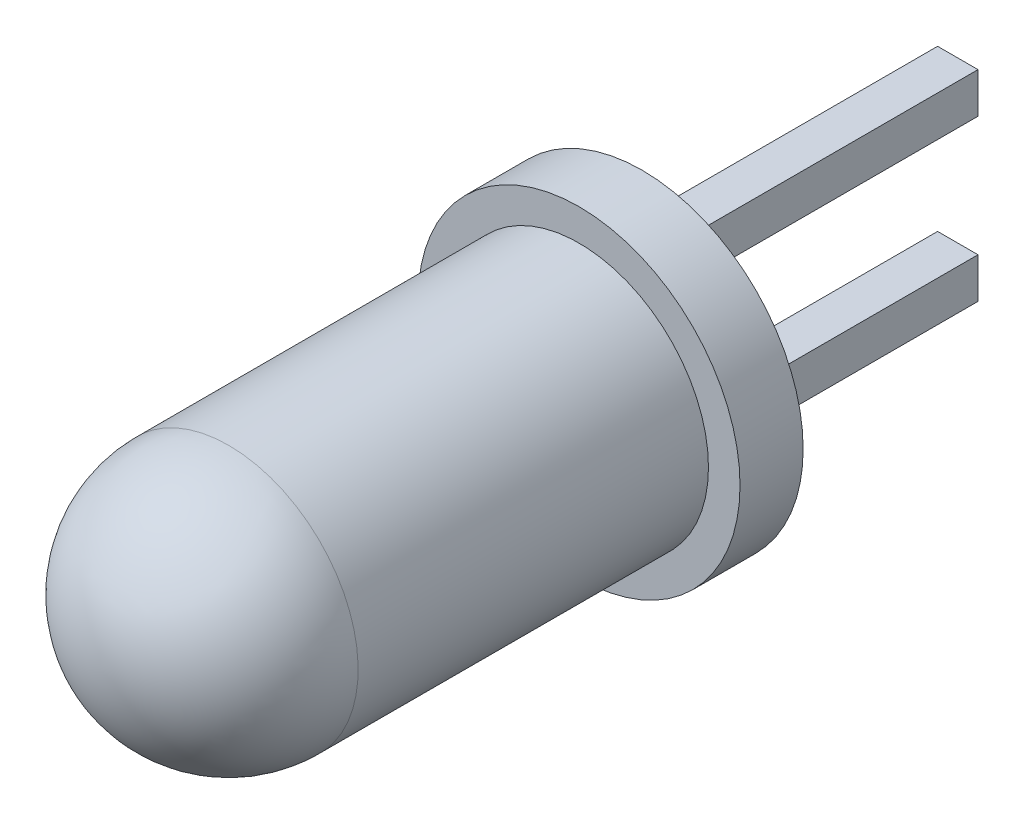
ISO-10303-21;
HEADER;
FILE_DESCRIPTION(('STEP AP214'),'2;1');
FILE_NAME('part.step','',(''),(''),'','','');
FILE_SCHEMA(('AUTOMOTIVE_DESIGN { 1 0 10303 214 1 1 1 1 }'));
ENDSEC;
DATA;
#1=APPLICATION_CONTEXT('core data for automotive mechanical design processes');
#2=APPLICATION_PROTOCOL_DEFINITION('international standard','automotive_design',2000,#1);
#3=PRODUCT_CONTEXT('',#1,'mechanical');
#4=PRODUCT('Part','Part','',(#3));
#5=PRODUCT_RELATED_PRODUCT_CATEGORY('part','',(#4));
#6=PRODUCT_DEFINITION_FORMATION('','',#4);
#7=PRODUCT_DEFINITION_CONTEXT('part definition',#1,'design');
#8=PRODUCT_DEFINITION('design','',#6,#7);
#9=PRODUCT_DEFINITION_SHAPE('','',#8);
#10=(LENGTH_UNIT() NAMED_UNIT(*) SI_UNIT(.MILLI.,.METRE.));
#11=(NAMED_UNIT(*) PLANE_ANGLE_UNIT() SI_UNIT($,.RADIAN.));
#12=(NAMED_UNIT(*) SI_UNIT($,.STERADIAN.) SOLID_ANGLE_UNIT());
#13=UNCERTAINTY_MEASURE_WITH_UNIT(LENGTH_MEASURE(1.E-05),#10,'distance_accuracy_value','');
#14=(GEOMETRIC_REPRESENTATION_CONTEXT(3) GLOBAL_UNCERTAINTY_ASSIGNED_CONTEXT((#13)) GLOBAL_UNIT_ASSIGNED_CONTEXT((#10,
#11,#12)) REPRESENTATION_CONTEXT('',''));
#15=CARTESIAN_POINT('',(0.,0.,0.));
#16=DIRECTION('',(0.,0.,1.));
#17=DIRECTION('',(1.,0.,0.));
#18=AXIS2_PLACEMENT_3D('',#15,#16,#17);
#19=CARTESIAN_POINT('',(0.,0.,0.));
#20=DIRECTION('',(0.,0.,-1.));
#21=DIRECTION('',(-1.,0.,0.));
#22=AXIS2_PLACEMENT_3D('',#19,#20,#21);
#23=PLANE('',#22);
#24=DIRECTION('',(1.,0.,0.));
#25=VECTOR('',#24,1.);
#26=CARTESIAN_POINT('',(-0.32,0.95,0.));
#27=LINE('',#26,#25);
#28=CARTESIAN_POINT('',(-0.32,0.95,0.));
#29=VERTEX_POINT('',#28);
#30=CARTESIAN_POINT('',(0.32,0.95,0.));
#31=VERTEX_POINT('',#30);
#32=EDGE_CURVE('E147',#29,#31,#27,.T.);
#33=ORIENTED_EDGE('',*,*,#32,.T.);
#34=DIRECTION('',(0.,-1.,0.));
#35=VECTOR('',#34,1.);
#36=CARTESIAN_POINT('',(0.32,1.59,0.));
#37=LINE('',#36,#35);
#38=CARTESIAN_POINT('',(0.32,1.59,0.));
#39=VERTEX_POINT('',#38);
#40=EDGE_CURVE('E113',#39,#31,#37,.T.);
#41=ORIENTED_EDGE('',*,*,#40,.F.);
#42=DIRECTION('',(-1.,0.,0.));
#43=VECTOR('',#42,1.);
#44=CARTESIAN_POINT('',(0.32,1.59,0.));
#45=LINE('',#44,#43);
#46=CARTESIAN_POINT('',(-0.32,1.59,0.));
#47=VERTEX_POINT('',#46);
#48=EDGE_CURVE('E136',#39,#47,#45,.T.);
#49=ORIENTED_EDGE('',*,*,#48,.T.);
#50=DIRECTION('',(0.,1.,0.));
#51=VECTOR('',#50,1.);
#52=CARTESIAN_POINT('',(-0.32,0.95,0.));
#53=LINE('',#52,#51);
#54=EDGE_CURVE('E149',#29,#47,#53,.T.);
#55=ORIENTED_EDGE('',*,*,#54,.F.);
#56=EDGE_LOOP('',(#33,#41,#49,#55));
#57=FACE_BOUND('',#56,.T.);
#58=CARTESIAN_POINT('',(0.,0.,0.));
#59=DIRECTION('',(0.,0.,-1.));
#60=DIRECTION('',(-1.,0.,0.));
#61=AXIS2_PLACEMENT_3D('',#58,#59,#60);
#62=CIRCLE('',#61,2.55);
#63=CARTESIAN_POINT('',(-2.55,0.,0.));
#64=VERTEX_POINT('',#63);
#65=EDGE_CURVE('E11',#64,#64,#62,.T.);
#66=ORIENTED_EDGE('',*,*,#65,.T.);
#67=EDGE_LOOP('',(#66));
#68=FACE_BOUND('',#67,.T.);
#69=DIRECTION('',(1.,0.,0.));
#70=VECTOR('',#69,1.);
#71=CARTESIAN_POINT('',(-0.32,-1.59,0.));
#72=LINE('',#71,#70);
#73=CARTESIAN_POINT('',(-0.32,-1.59,0.));
#74=VERTEX_POINT('',#73);
#75=CARTESIAN_POINT('',(0.320000000000001,-1.59,0.));
#76=VERTEX_POINT('',#75);
#77=EDGE_CURVE('E47',#74,#76,#72,.T.);
#78=ORIENTED_EDGE('',*,*,#77,.T.);
#79=DIRECTION('',(0.,-1.,0.));
#80=VECTOR('',#79,1.);
#81=CARTESIAN_POINT('',(0.320000000000001,-0.95,0.));
#82=LINE('',#81,#80);
#83=CARTESIAN_POINT('',(0.320000000000001,-0.95,0.));
#84=VERTEX_POINT('',#83);
#85=EDGE_CURVE('E111',#84,#76,#82,.T.);
#86=ORIENTED_EDGE('',*,*,#85,.F.);
#87=DIRECTION('',(-1.,0.,0.));
#88=VECTOR('',#87,1.);
#89=CARTESIAN_POINT('',(0.320000000000001,-0.95,0.));
#90=LINE('',#89,#88);
#91=CARTESIAN_POINT('',(-0.32,-0.95,0.));
#92=VERTEX_POINT('',#91);
#93=EDGE_CURVE('E106',#84,#92,#90,.T.);
#94=ORIENTED_EDGE('',*,*,#93,.T.);
#95=DIRECTION('',(0.,1.,0.));
#96=VECTOR('',#95,1.);
#97=CARTESIAN_POINT('',(-0.32,-1.59,0.));
#98=LINE('',#97,#96);
#99=EDGE_CURVE('E52',#74,#92,#98,.T.);
#100=ORIENTED_EDGE('',*,*,#99,.F.);
#101=EDGE_LOOP('',(#78,#86,#94,#100));
#102=FACE_BOUND('',#101,.T.);
#103=ADVANCED_FACE('F33',(#57,#68,#102),#23,.T.);
#104=CARTESIAN_POINT('',(0.,0.,0.));
#105=DIRECTION('',(0.,0.,-1.));
#106=DIRECTION('',(-1.,0.,0.));
#107=AXIS2_PLACEMENT_3D('',#104,#105,#106);
#108=CYLINDRICAL_SURFACE('',#107,2.55);
#109=CARTESIAN_POINT('',(0.,0.,1.));
#110=DIRECTION('',(0.,0.,-1.));
#111=DIRECTION('',(-1.,0.,0.));
#112=AXIS2_PLACEMENT_3D('',#109,#110,#111);
#113=CIRCLE('',#112,2.55);
#114=CARTESIAN_POINT('',(-2.55,0.,1.));
#115=VERTEX_POINT('',#114);
#116=EDGE_CURVE('E40',#115,#115,#113,.T.);
#117=ORIENTED_EDGE('',*,*,#116,.T.);
#118=EDGE_LOOP('',(#117));
#119=FACE_BOUND('',#118,.T.);
#120=ORIENTED_EDGE('',*,*,#65,.F.);
#121=EDGE_LOOP('',(#120));
#122=FACE_BOUND('',#121,.T.);
#123=ADVANCED_FACE('F172',(#119,#122),#108,.T.);
#124=CARTESIAN_POINT('',(0.,2.55,1.));
#125=DIRECTION('',(0.,0.,1.));
#126=DIRECTION('',(1.,0.,0.));
#127=AXIS2_PLACEMENT_3D('',#124,#125,#126);
#128=PLANE('',#127);
#129=CARTESIAN_POINT('',(0.,0.,1.));
#130=DIRECTION('',(0.,0.,-1.));
#131=DIRECTION('',(-1.,0.,0.));
#132=AXIS2_PLACEMENT_3D('',#129,#130,#131);
#133=CIRCLE('',#132,2.05);
#134=CARTESIAN_POINT('',(-2.05,0.,1.));
#135=VERTEX_POINT('',#134);
#136=EDGE_CURVE('E167',#135,#135,#133,.T.);
#137=ORIENTED_EDGE('',*,*,#136,.T.);
#138=EDGE_LOOP('',(#137));
#139=FACE_BOUND('',#138,.T.);
#140=ORIENTED_EDGE('',*,*,#116,.F.);
#141=EDGE_LOOP('',(#140));
#142=FACE_BOUND('',#141,.T.);
#143=ADVANCED_FACE('F175',(#139,#142),#128,.T.);
#144=CARTESIAN_POINT('',(0.,0.,0.));
#145=DIRECTION('',(0.,0.,-1.));
#146=DIRECTION('',(-1.,0.,0.));
#147=AXIS2_PLACEMENT_3D('',#144,#145,#146);
#148=CYLINDRICAL_SURFACE('',#147,2.05);
#149=CARTESIAN_POINT('',(0.,0.,6.55));
#150=DIRECTION('',(0.,0.,-1.));
#151=DIRECTION('',(-1.,0.,0.));
#152=AXIS2_PLACEMENT_3D('',#149,#150,#151);
#153=CIRCLE('',#152,2.05);
#154=CARTESIAN_POINT('',(-2.05,0.,6.55));
#155=VERTEX_POINT('',#154);
#156=EDGE_CURVE('E164',#155,#155,#153,.T.);
#157=ORIENTED_EDGE('',*,*,#156,.T.);
#158=EDGE_LOOP('',(#157));
#159=FACE_BOUND('',#158,.T.);
#160=ORIENTED_EDGE('',*,*,#136,.F.);
#161=EDGE_LOOP('',(#160));
#162=FACE_BOUND('',#161,.T.);
#163=ADVANCED_FACE('F177',(#159,#162),#148,.T.);
#164=CARTESIAN_POINT('',(0.,0.,6.55));
#165=DIRECTION('',(0.,0.,-1.));
#166=DIRECTION('',(0.,1.,0.));
#167=AXIS2_PLACEMENT_3D('',#164,#165,#166);
#168=SPHERICAL_SURFACE('',#167,2.05);
#169=ORIENTED_EDGE('',*,*,#156,.F.);
#170=EDGE_LOOP('',(#169));
#171=FACE_BOUND('',#170,.T.);
#172=ADVANCED_FACE('F184',(#171),#168,.T.);
#173=CARTESIAN_POINT('',(0.32,1.59,-5.));
#174=DIRECTION('',(-1.,0.,0.));
#175=DIRECTION('',(0.,-1.,0.));
#176=AXIS2_PLACEMENT_3D('',#173,#174,#175);
#177=PLANE('',#176);
#178=ORIENTED_EDGE('',*,*,#40,.T.);
#179=DIRECTION('',(0.,0.,1.));
#180=VECTOR('',#179,1.);
#181=CARTESIAN_POINT('',(0.32,0.95,-5.));
#182=LINE('',#181,#180);
#183=CARTESIAN_POINT('',(0.32,0.95,-5.));
#184=VERTEX_POINT('',#183);
#185=EDGE_CURVE('E161',#184,#31,#182,.T.);
#186=ORIENTED_EDGE('',*,*,#185,.F.);
#187=DIRECTION('',(0.,-1.,0.));
#188=VECTOR('',#187,1.);
#189=CARTESIAN_POINT('',(0.32,1.59,-5.));
#190=LINE('',#189,#188);
#191=CARTESIAN_POINT('',(0.32,1.59,-5.));
#192=VERTEX_POINT('',#191);
#193=EDGE_CURVE('E133',#192,#184,#190,.T.);
#194=ORIENTED_EDGE('',*,*,#193,.F.);
#195=DIRECTION('',(0.,0.,1.));
#196=VECTOR('',#195,1.);
#197=CARTESIAN_POINT('',(0.32,1.59,-5.));
#198=LINE('',#197,#196);
#199=EDGE_CURVE('E144',#192,#39,#198,.T.);
#200=ORIENTED_EDGE('',*,*,#199,.T.);
#201=EDGE_LOOP('',(#178,#186,#194,#200));
#202=FACE_BOUND('',#201,.T.);
#203=ADVANCED_FACE('F200',(#202),#177,.F.);
#204=CARTESIAN_POINT('',(-0.32,0.95,-5.));
#205=DIRECTION('',(0.,-1.,0.));
#206=DIRECTION('',(1.,0.,0.));
#207=AXIS2_PLACEMENT_3D('',#204,#205,#206);
#208=PLANE('',#207);
#209=ORIENTED_EDGE('',*,*,#32,.F.);
#210=DIRECTION('',(0.,0.,1.));
#211=VECTOR('',#210,1.);
#212=CARTESIAN_POINT('',(-0.32,0.95,-5.));
#213=LINE('',#212,#211);
#214=CARTESIAN_POINT('',(-0.32,0.95,-5.));
#215=VERTEX_POINT('',#214);
#216=EDGE_CURVE('E158',#215,#29,#213,.T.);
#217=ORIENTED_EDGE('',*,*,#216,.F.);
#218=DIRECTION('',(1.,0.,0.));
#219=VECTOR('',#218,1.);
#220=CARTESIAN_POINT('',(-0.32,0.95,-5.));
#221=LINE('',#220,#219);
#222=EDGE_CURVE('E135',#215,#184,#221,.T.);
#223=ORIENTED_EDGE('',*,*,#222,.T.);
#224=ORIENTED_EDGE('',*,*,#185,.T.);
#225=EDGE_LOOP('',(#209,#217,#223,#224));
#226=FACE_BOUND('',#225,.T.);
#227=ADVANCED_FACE('F196',(#226),#208,.T.);
#228=CARTESIAN_POINT('',(-0.32,0.95,-5.));
#229=DIRECTION('',(1.,0.,0.));
#230=DIRECTION('',(0.,1.,0.));
#231=AXIS2_PLACEMENT_3D('',#228,#229,#230);
#232=PLANE('',#231);
#233=ORIENTED_EDGE('',*,*,#54,.T.);
#234=DIRECTION('',(0.,0.,1.));
#235=VECTOR('',#234,1.);
#236=CARTESIAN_POINT('',(-0.32,1.59,-5.));
#237=LINE('',#236,#235);
#238=CARTESIAN_POINT('',(-0.32,1.59,-5.));
#239=VERTEX_POINT('',#238);
#240=EDGE_CURVE('E155',#239,#47,#237,.T.);
#241=ORIENTED_EDGE('',*,*,#240,.F.);
#242=DIRECTION('',(0.,1.,0.));
#243=VECTOR('',#242,1.);
#244=CARTESIAN_POINT('',(-0.32,0.95,-5.));
#245=LINE('',#244,#243);
#246=EDGE_CURVE('E139',#215,#239,#245,.T.);
#247=ORIENTED_EDGE('',*,*,#246,.F.);
#248=ORIENTED_EDGE('',*,*,#216,.T.);
#249=EDGE_LOOP('',(#233,#241,#247,#248));
#250=FACE_BOUND('',#249,.T.);
#251=ADVANCED_FACE('F208',(#250),#232,.F.);
#252=CARTESIAN_POINT('',(0.32,1.59,-5.));
#253=DIRECTION('',(0.,1.,0.));
#254=DIRECTION('',(0.,0.,1.));
#255=AXIS2_PLACEMENT_3D('',#252,#253,#254);
#256=PLANE('',#255);
#257=ORIENTED_EDGE('',*,*,#48,.F.);
#258=ORIENTED_EDGE('',*,*,#199,.F.);
#259=DIRECTION('',(-1.,0.,0.));
#260=VECTOR('',#259,1.);
#261=CARTESIAN_POINT('',(0.32,1.59,-5.));
#262=LINE('',#261,#260);
#263=EDGE_CURVE('E141',#192,#239,#262,.T.);
#264=ORIENTED_EDGE('',*,*,#263,.T.);
#265=ORIENTED_EDGE('',*,*,#240,.T.);
#266=EDGE_LOOP('',(#257,#258,#264,#265));
#267=FACE_BOUND('',#266,.T.);
#268=ADVANCED_FACE('F204',(#267),#256,.T.);
#269=CARTESIAN_POINT('',(0.32,0.95,-5.));
#270=DIRECTION('',(0.,0.,1.));
#271=DIRECTION('',(1.,0.,0.));
#272=AXIS2_PLACEMENT_3D('',#269,#270,#271);
#273=PLANE('',#272);
#274=ORIENTED_EDGE('',*,*,#193,.T.);
#275=ORIENTED_EDGE('',*,*,#222,.F.);
#276=ORIENTED_EDGE('',*,*,#246,.T.);
#277=ORIENTED_EDGE('',*,*,#263,.F.);
#278=EDGE_LOOP('',(#274,#275,#276,#277));
#279=FACE_BOUND('',#278,.T.);
#280=ADVANCED_FACE('F210',(#279),#273,.F.);
#281=CARTESIAN_POINT('',(0.320000000000001,-0.95,-5.));
#282=DIRECTION('',(-1.,0.,0.));
#283=DIRECTION('',(0.,-1.,0.));
#284=AXIS2_PLACEMENT_3D('',#281,#282,#283);
#285=PLANE('',#284);
#286=ORIENTED_EDGE('',*,*,#85,.T.);
#287=DIRECTION('',(0.,0.,1.));
#288=VECTOR('',#287,1.);
#289=CARTESIAN_POINT('',(0.320000000000001,-1.59,-5.));
#290=LINE('',#289,#288);
#291=CARTESIAN_POINT('',(0.320000000000001,-1.59,-5.));
#292=VERTEX_POINT('',#291);
#293=EDGE_CURVE('E109',#292,#76,#290,.T.);
#294=ORIENTED_EDGE('',*,*,#293,.F.);
#295=DIRECTION('',(0.,-1.,0.));
#296=VECTOR('',#295,1.);
#297=CARTESIAN_POINT('',(0.320000000000001,-0.95,-5.));
#298=LINE('',#297,#296);
#299=CARTESIAN_POINT('',(0.320000000000001,-0.95,-5.));
#300=VERTEX_POINT('',#299);
#301=EDGE_CURVE('E97',#300,#292,#298,.T.);
#302=ORIENTED_EDGE('',*,*,#301,.F.);
#303=DIRECTION('',(0.,0.,1.));
#304=VECTOR('',#303,1.);
#305=CARTESIAN_POINT('',(0.320000000000001,-0.95,-5.));
#306=LINE('',#305,#304);
#307=EDGE_CURVE('E123',#300,#84,#306,.T.);
#308=ORIENTED_EDGE('',*,*,#307,.T.);
#309=EDGE_LOOP('',(#286,#294,#302,#308));
#310=FACE_BOUND('',#309,.T.);
#311=ADVANCED_FACE('F110',(#310),#285,.F.);
#312=CARTESIAN_POINT('',(-0.32,-1.59,-5.));
#313=DIRECTION('',(0.,-1.,0.));
#314=DIRECTION('',(1.,0.,0.));
#315=AXIS2_PLACEMENT_3D('',#312,#313,#314);
#316=PLANE('',#315);
#317=ORIENTED_EDGE('',*,*,#77,.F.);
#318=DIRECTION('',(0.,0.,1.));
#319=VECTOR('',#318,1.);
#320=CARTESIAN_POINT('',(-0.32,-1.59,-5.));
#321=LINE('',#320,#319);
#322=CARTESIAN_POINT('',(-0.32,-1.59,-5.));
#323=VERTEX_POINT('',#322);
#324=EDGE_CURVE('E114',#323,#74,#321,.T.);
#325=ORIENTED_EDGE('',*,*,#324,.F.);
#326=DIRECTION('',(1.,0.,0.));
#327=VECTOR('',#326,1.);
#328=CARTESIAN_POINT('',(-0.32,-1.59,-5.));
#329=LINE('',#328,#327);
#330=EDGE_CURVE('E101',#323,#292,#329,.T.);
#331=ORIENTED_EDGE('',*,*,#330,.T.);
#332=ORIENTED_EDGE('',*,*,#293,.T.);
#333=EDGE_LOOP('',(#317,#325,#331,#332));
#334=FACE_BOUND('',#333,.T.);
#335=ADVANCED_FACE('F116',(#334),#316,.T.);
#336=CARTESIAN_POINT('',(-0.32,-1.59,-5.));
#337=DIRECTION('',(1.,0.,0.));
#338=DIRECTION('',(0.,0.,-1.));
#339=AXIS2_PLACEMENT_3D('',#336,#337,#338);
#340=PLANE('',#339);
#341=ORIENTED_EDGE('',*,*,#99,.T.);
#342=DIRECTION('',(0.,0.,1.));
#343=VECTOR('',#342,1.);
#344=CARTESIAN_POINT('',(-0.32,-0.95,-5.));
#345=LINE('',#344,#343);
#346=CARTESIAN_POINT('',(-0.32,-0.95,-5.));
#347=VERTEX_POINT('',#346);
#348=EDGE_CURVE('E129',#347,#92,#345,.T.);
#349=ORIENTED_EDGE('',*,*,#348,.F.);
#350=DIRECTION('',(0.,1.,0.));
#351=VECTOR('',#350,1.);
#352=CARTESIAN_POINT('',(-0.32,-1.59,-5.));
#353=LINE('',#352,#351);
#354=EDGE_CURVE('E118',#323,#347,#353,.T.);
#355=ORIENTED_EDGE('',*,*,#354,.F.);
#356=ORIENTED_EDGE('',*,*,#324,.T.);
#357=EDGE_LOOP('',(#341,#349,#355,#356));
#358=FACE_BOUND('',#357,.T.);
#359=ADVANCED_FACE('F272',(#358),#340,.F.);
#360=CARTESIAN_POINT('',(0.320000000000001,-0.95,-5.));
#361=DIRECTION('',(0.,1.,0.));
#362=DIRECTION('',(-1.,0.,0.));
#363=AXIS2_PLACEMENT_3D('',#360,#361,#362);
#364=PLANE('',#363);
#365=ORIENTED_EDGE('',*,*,#93,.F.);
#366=ORIENTED_EDGE('',*,*,#307,.F.);
#367=DIRECTION('',(-1.,0.,0.));
#368=VECTOR('',#367,1.);
#369=CARTESIAN_POINT('',(0.320000000000001,-0.95,-5.));
#370=LINE('',#369,#368);
#371=EDGE_CURVE('E103',#300,#347,#370,.T.);
#372=ORIENTED_EDGE('',*,*,#371,.T.);
#373=ORIENTED_EDGE('',*,*,#348,.T.);
#374=EDGE_LOOP('',(#365,#366,#372,#373));
#375=FACE_BOUND('',#374,.T.);
#376=ADVANCED_FACE('F280',(#375),#364,.T.);
#377=CARTESIAN_POINT('',(0.320000000000001,-0.95,-5.));
#378=DIRECTION('',(0.,0.,-1.));
#379=DIRECTION('',(-1.,0.,0.));
#380=AXIS2_PLACEMENT_3D('',#377,#378,#379);
#381=PLANE('',#380);
#382=ORIENTED_EDGE('',*,*,#301,.T.);
#383=ORIENTED_EDGE('',*,*,#330,.F.);
#384=ORIENTED_EDGE('',*,*,#354,.T.);
#385=ORIENTED_EDGE('',*,*,#371,.F.);
#386=EDGE_LOOP('',(#382,#383,#384,#385));
#387=FACE_BOUND('',#386,.T.);
#388=ADVANCED_FACE('F99',(#387),#381,.T.);
#389=CLOSED_SHELL('',(#103,#123,#143,#163,#172,#203,#227,#251,#268,#280,#311,#335,#359,#376,#388));
#390=MANIFOLD_SOLID_BREP('B2',#389);
#391=ADVANCED_BREP_SHAPE_REPRESENTATION('',(#18,#390),#14);
#392=SHAPE_DEFINITION_REPRESENTATION(#9,#391);
ENDSEC;
END-ISO-10303-21;
